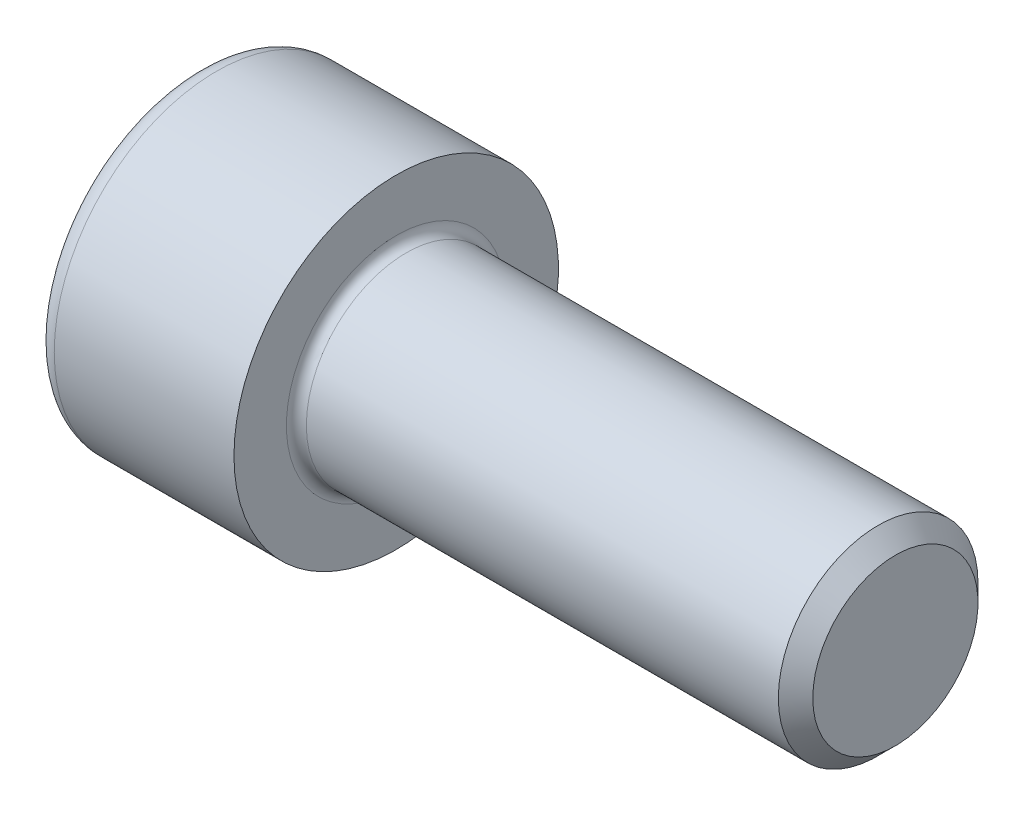
ISO-10303-21;
HEADER;
FILE_DESCRIPTION(('STEP AP214'),'2;1');
FILE_NAME('part.step','',(''),(''),'','','');
FILE_SCHEMA(('AUTOMOTIVE_DESIGN { 1 0 10303 214 1 1 1 1 }'));
ENDSEC;
DATA;
#1=APPLICATION_CONTEXT('core data for automotive mechanical design processes');
#2=APPLICATION_PROTOCOL_DEFINITION('international standard','automotive_design',2000,#1);
#3=PRODUCT_CONTEXT('',#1,'mechanical');
#4=PRODUCT('Part','Part','',(#3));
#5=PRODUCT_RELATED_PRODUCT_CATEGORY('part','',(#4));
#6=PRODUCT_DEFINITION_FORMATION('','',#4);
#7=PRODUCT_DEFINITION_CONTEXT('part definition',#1,'design');
#8=PRODUCT_DEFINITION('design','',#6,#7);
#9=PRODUCT_DEFINITION_SHAPE('','',#8);
#10=(LENGTH_UNIT() NAMED_UNIT(*) SI_UNIT(.MILLI.,.METRE.));
#11=(NAMED_UNIT(*) PLANE_ANGLE_UNIT() SI_UNIT($,.RADIAN.));
#12=(NAMED_UNIT(*) SI_UNIT($,.STERADIAN.) SOLID_ANGLE_UNIT());
#13=UNCERTAINTY_MEASURE_WITH_UNIT(LENGTH_MEASURE(1.E-05),#10,'distance_accuracy_value','');
#14=(GEOMETRIC_REPRESENTATION_CONTEXT(3) GLOBAL_UNCERTAINTY_ASSIGNED_CONTEXT((#13)) GLOBAL_UNIT_ASSIGNED_CONTEXT((#10,
#11,#12)) REPRESENTATION_CONTEXT('',''));
#15=CARTESIAN_POINT('',(0.,0.,0.));
#16=DIRECTION('',(0.,0.,1.));
#17=DIRECTION('',(1.,0.,0.));
#18=AXIS2_PLACEMENT_3D('',#15,#16,#17);
#19=CARTESIAN_POINT('',(0.,0.,0.));
#20=DIRECTION('',(-1.,0.,0.));
#21=DIRECTION('',(0.,0.,1.));
#22=AXIS2_PLACEMENT_3D('',#19,#20,#21);
#23=PLANE('',#22);
#24=DIRECTION('',(0.,-0.499999999999998,0.86602540378444));
#25=VECTOR('',#24,1.);
#26=CARTESIAN_POINT('',(0.,3.47564862052154,0.));
#27=LINE('',#26,#25);
#28=CARTESIAN_POINT('',(0.,3.47564862052154,0.));
#29=VERTEX_POINT('',#28);
#30=CARTESIAN_POINT('',(0.,1.73782431026077,3.01));
#31=VERTEX_POINT('',#30);
#32=EDGE_CURVE('E270',#29,#31,#27,.T.);
#33=ORIENTED_EDGE('',*,*,#32,.T.);
#34=DIRECTION('',(0.,1.,0.));
#35=VECTOR('',#34,1.);
#36=CARTESIAN_POINT('',(0.,-1.73782431026078,3.01000000000001));
#37=LINE('',#36,#35);
#38=CARTESIAN_POINT('',(0.,-1.73782431026078,3.01000000000001));
#39=VERTEX_POINT('',#38);
#40=EDGE_CURVE('E131',#39,#31,#37,.T.);
#41=ORIENTED_EDGE('',*,*,#40,.F.);
#42=DIRECTION('',(0.,-0.500000000000001,-0.866025403784438));
#43=VECTOR('',#42,1.);
#44=CARTESIAN_POINT('',(0.,-1.73782431026078,3.01000000000001));
#45=LINE('',#44,#43);
#46=CARTESIAN_POINT('',(0.,-3.47564862052155,0.));
#47=VERTEX_POINT('',#46);
#48=EDGE_CURVE('E273',#39,#47,#45,.T.);
#49=ORIENTED_EDGE('',*,*,#48,.T.);
#50=DIRECTION('',(0.,0.499999999999998,-0.86602540378444));
#51=VECTOR('',#50,1.);
#52=CARTESIAN_POINT('',(0.,-3.47564862052155,0.));
#53=LINE('',#52,#51);
#54=CARTESIAN_POINT('',(0.,-1.73782431026079,-3.00999999999999));
#55=VERTEX_POINT('',#54);
#56=EDGE_CURVE('E276',#47,#55,#53,.T.);
#57=ORIENTED_EDGE('',*,*,#56,.T.);
#58=DIRECTION('',(0.,-1.,0.));
#59=VECTOR('',#58,1.);
#60=CARTESIAN_POINT('',(0.,1.73782431026076,-3.01));
#61=LINE('',#60,#59);
#62=CARTESIAN_POINT('',(0.,1.73782431026076,-3.01));
#63=VERTEX_POINT('',#62);
#64=EDGE_CURVE('E279',#63,#55,#61,.T.);
#65=ORIENTED_EDGE('',*,*,#64,.F.);
#66=DIRECTION('',(0.,-0.500000000000001,-0.866025403784438));
#67=VECTOR('',#66,1.);
#68=CARTESIAN_POINT('',(0.,3.47564862052154,0.));
#69=LINE('',#68,#67);
#70=EDGE_CURVE('E126',#29,#63,#69,.T.);
#71=ORIENTED_EDGE('',*,*,#70,.F.);
#72=EDGE_LOOP('',(#33,#41,#49,#57,#65,#71));
#73=FACE_BOUND('',#72,.T.);
#74=CARTESIAN_POINT('',(0.,0.,0.));
#75=DIRECTION('',(-1.,0.,0.));
#76=DIRECTION('',(0.,0.,1.));
#77=AXIS2_PLACEMENT_3D('',#74,#75,#76);
#78=CIRCLE('',#77,5.7);
#79=CARTESIAN_POINT('',(0.,0.,5.7));
#80=VERTEX_POINT('',#79);
#81=EDGE_CURVE('E47',#80,#80,#78,.T.);
#82=ORIENTED_EDGE('',*,*,#81,.T.);
#83=EDGE_LOOP('',(#82));
#84=FACE_BOUND('',#83,.T.);
#85=ADVANCED_FACE('F39',(#73,#84),#23,.T.);
#86=CARTESIAN_POINT('',(-31.75,0.,0.));
#87=DIRECTION('',(-1.,0.,0.));
#88=DIRECTION('',(0.,0.,1.));
#89=AXIS2_PLACEMENT_3D('',#86,#87,#88);
#90=CYLINDRICAL_SURFACE('',#89,6.5);
#91=CARTESIAN_POINT('',(0.800000000000002,0.,0.));
#92=DIRECTION('',(-1.,0.,0.));
#93=DIRECTION('',(0.,0.,1.));
#94=AXIS2_PLACEMENT_3D('',#91,#92,#93);
#95=CIRCLE('',#94,6.5);
#96=CARTESIAN_POINT('',(0.800000000000002,0.,6.5));
#97=VERTEX_POINT('',#96);
#98=EDGE_CURVE('E11',#97,#97,#95,.F.);
#99=ORIENTED_EDGE('',*,*,#98,.T.);
#100=EDGE_LOOP('',(#99));
#101=FACE_BOUND('',#100,.T.);
#102=CARTESIAN_POINT('',(8.,0.,0.));
#103=DIRECTION('',(-1.,0.,0.));
#104=DIRECTION('',(0.,0.,1.));
#105=AXIS2_PLACEMENT_3D('',#102,#103,#104);
#106=CIRCLE('',#105,6.5);
#107=CARTESIAN_POINT('',(8.,0.,6.5));
#108=VERTEX_POINT('',#107);
#109=EDGE_CURVE('E149',#108,#108,#106,.T.);
#110=ORIENTED_EDGE('',*,*,#109,.T.);
#111=EDGE_LOOP('',(#110));
#112=FACE_BOUND('',#111,.T.);
#113=ADVANCED_FACE('F173',(#101,#112),#90,.T.);
#114=CARTESIAN_POINT('',(8.,6.5,0.));
#115=DIRECTION('',(1.,0.,0.));
#116=DIRECTION('',(0.,0.,-1.));
#117=AXIS2_PLACEMENT_3D('',#114,#115,#116);
#118=PLANE('',#117);
#119=CARTESIAN_POINT('',(8.,0.,0.));
#120=DIRECTION('',(1.,0.,0.));
#121=DIRECTION('',(0.,0.,-1.));
#122=AXIS2_PLACEMENT_3D('',#119,#120,#121);
#123=CIRCLE('',#122,4.39999999999999);
#124=CARTESIAN_POINT('',(8.,0.,-4.39999999999999));
#125=VERTEX_POINT('',#124);
#126=EDGE_CURVE('E152',#125,#125,#123,.F.);
#127=ORIENTED_EDGE('',*,*,#126,.T.);
#128=EDGE_LOOP('',(#127));
#129=FACE_BOUND('',#128,.T.);
#130=ORIENTED_EDGE('',*,*,#109,.F.);
#131=EDGE_LOOP('',(#130));
#132=FACE_BOUND('',#131,.T.);
#133=ADVANCED_FACE('F179',(#129,#132),#118,.T.);
#134=CARTESIAN_POINT('',(-31.75,0.,0.));
#135=DIRECTION('',(-1.,0.,0.));
#136=DIRECTION('',(0.,0.,1.));
#137=AXIS2_PLACEMENT_3D('',#134,#135,#136);
#138=CYLINDRICAL_SURFACE('',#137,3.99999999999999);
#139=CARTESIAN_POINT('',(8.4,0.,0.));
#140=DIRECTION('',(1.,0.,0.));
#141=DIRECTION('',(0.,0.,-1.));
#142=AXIS2_PLACEMENT_3D('',#139,#140,#141);
#143=CIRCLE('',#142,3.99999999999999);
#144=CARTESIAN_POINT('',(8.4,0.,-3.99999999999999));
#145=VERTEX_POINT('',#144);
#146=EDGE_CURVE('E155',#145,#145,#143,.T.);
#147=ORIENTED_EDGE('',*,*,#146,.T.);
#148=EDGE_LOOP('',(#147));
#149=FACE_BOUND('',#148,.T.);
#150=CARTESIAN_POINT('',(27.3095,0.,0.));
#151=DIRECTION('',(-1.,0.,0.));
#152=DIRECTION('',(0.,0.,1.));
#153=AXIS2_PLACEMENT_3D('',#150,#151,#152);
#154=CIRCLE('',#153,3.99999999999998);
#155=CARTESIAN_POINT('',(27.3095,0.,3.99999999999998));
#156=VERTEX_POINT('',#155);
#157=EDGE_CURVE('E146',#156,#156,#154,.T.);
#158=ORIENTED_EDGE('',*,*,#157,.T.);
#159=EDGE_LOOP('',(#158));
#160=FACE_BOUND('',#159,.T.);
#161=ADVANCED_FACE('F185',(#149,#160),#138,.T.);
#162=CARTESIAN_POINT('',(28.,0.,0.));
#163=DIRECTION('',(-1.,0.,0.));
#164=DIRECTION('',(0.,0.,1.));
#165=AXIS2_PLACEMENT_3D('',#162,#163,#164);
#166=CONICAL_SURFACE('',#165,3.3095,0.785398163397426);
#167=ORIENTED_EDGE('',*,*,#157,.F.);
#168=EDGE_LOOP('',(#167));
#169=FACE_BOUND('',#168,.T.);
#170=CARTESIAN_POINT('',(28.,0.,0.));
#171=DIRECTION('',(-1.,0.,0.));
#172=DIRECTION('',(0.,0.,1.));
#173=AXIS2_PLACEMENT_3D('',#170,#171,#172);
#174=CIRCLE('',#173,3.3095);
#175=CARTESIAN_POINT('',(28.,0.,3.3095));
#176=VERTEX_POINT('',#175);
#177=EDGE_CURVE('E142',#176,#176,#174,.T.);
#178=ORIENTED_EDGE('',*,*,#177,.T.);
#179=EDGE_LOOP('',(#178));
#180=FACE_BOUND('',#179,.T.);
#181=ADVANCED_FACE('F189',(#169,#180),#166,.T.);
#182=CARTESIAN_POINT('',(28.,3.3095,0.));
#183=DIRECTION('',(1.,0.,0.));
#184=DIRECTION('',(0.,0.,-1.));
#185=AXIS2_PLACEMENT_3D('',#182,#183,#184);
#186=PLANE('',#185);
#187=ORIENTED_EDGE('',*,*,#177,.F.);
#188=EDGE_LOOP('',(#187));
#189=FACE_BOUND('',#188,.T.);
#190=ADVANCED_FACE('F169',(#189),#186,.T.);
#191=CARTESIAN_POINT('',(8.4,0.,0.));
#192=DIRECTION('',(1.,0.,0.));
#193=DIRECTION('',(0.,0.,-1.));
#194=AXIS2_PLACEMENT_3D('',#191,#192,#193);
#195=TOROIDAL_SURFACE('',#194,4.39999999999999,0.4);
#196=ORIENTED_EDGE('',*,*,#146,.F.);
#197=EDGE_LOOP('',(#196));
#198=FACE_BOUND('',#197,.T.);
#199=ORIENTED_EDGE('',*,*,#126,.F.);
#200=EDGE_LOOP('',(#199));
#201=FACE_BOUND('',#200,.T.);
#202=ADVANCED_FACE('F162',(#198,#201),#195,.F.);
#203=CARTESIAN_POINT('',(0.800000000000002,0.,0.));
#204=DIRECTION('',(-1.,0.,0.));
#205=DIRECTION('',(0.,0.,1.));
#206=AXIS2_PLACEMENT_3D('',#203,#204,#205);
#207=TOROIDAL_SURFACE('',#206,5.7,0.8);
#208=ORIENTED_EDGE('',*,*,#98,.F.);
#209=EDGE_LOOP('',(#208));
#210=FACE_BOUND('',#209,.T.);
#211=ORIENTED_EDGE('',*,*,#81,.F.);
#212=EDGE_LOOP('',(#211));
#213=FACE_BOUND('',#212,.T.);
#214=ADVANCED_FACE('F41',(#210,#213),#207,.T.);
#215=CARTESIAN_POINT('',(4.,3.47564862052154,0.));
#216=DIRECTION('',(0.,-0.86602540378444,-0.499999999999998));
#217=DIRECTION('',(0.,0.499999999999998,-0.86602540378444));
#218=AXIS2_PLACEMENT_3D('',#215,#216,#217);
#219=PLANE('',#218);
#220=ORIENTED_EDGE('',*,*,#32,.F.);
#221=DIRECTION('',(-1.,0.,0.));
#222=VECTOR('',#221,1.);
#223=CARTESIAN_POINT('',(4.,3.47564862052154,0.));
#224=LINE('',#223,#222);
#225=CARTESIAN_POINT('',(4.,3.47564862052154,0.));
#226=VERTEX_POINT('',#225);
#227=EDGE_CURVE('E269',#226,#29,#224,.T.);
#228=ORIENTED_EDGE('',*,*,#227,.F.);
#229=DIRECTION('',(0.,-0.499999999999998,0.86602540378444));
#230=VECTOR('',#229,1.);
#231=CARTESIAN_POINT('',(4.,3.47564862052154,0.));
#232=LINE('',#231,#230);
#233=CARTESIAN_POINT('',(4.,2.60673646539116,1.50499999999999));
#234=VERTEX_POINT('',#233);
#235=EDGE_CURVE('E54',#226,#234,#232,.T.);
#236=ORIENTED_EDGE('',*,*,#235,.T.);
#237=CARTESIAN_POINT('',(4.,1.73782431026077,3.01));
#238=VERTEX_POINT('',#237);
#239=EDGE_CURVE('E112',#234,#238,#232,.T.);
#240=ORIENTED_EDGE('',*,*,#239,.T.);
#241=DIRECTION('',(-1.,0.,0.));
#242=VECTOR('',#241,1.);
#243=CARTESIAN_POINT('',(4.,1.73782431026077,3.01));
#244=LINE('',#243,#242);
#245=EDGE_CURVE('E124',#238,#31,#244,.T.);
#246=ORIENTED_EDGE('',*,*,#245,.T.);
#247=EDGE_LOOP('',(#220,#228,#236,#240,#246));
#248=FACE_BOUND('',#247,.T.);
#249=ADVANCED_FACE('F123',(#248),#219,.T.);
#250=CARTESIAN_POINT('',(4.,-1.73782431026078,3.01000000000001));
#251=DIRECTION('',(0.,0.,1.));
#252=DIRECTION('',(0.,-1.,0.));
#253=AXIS2_PLACEMENT_3D('',#250,#251,#252);
#254=PLANE('',#253);
#255=ORIENTED_EDGE('',*,*,#40,.T.);
#256=ORIENTED_EDGE('',*,*,#245,.F.);
#257=DIRECTION('',(0.,1.,0.));
#258=VECTOR('',#257,1.);
#259=CARTESIAN_POINT('',(4.,-1.73782431026078,3.01000000000001));
#260=LINE('',#259,#258);
#261=CARTESIAN_POINT('',(4.,0.,3.01));
#262=VERTEX_POINT('',#261);
#263=EDGE_CURVE('E110',#262,#238,#260,.T.);
#264=ORIENTED_EDGE('',*,*,#263,.F.);
#265=CARTESIAN_POINT('',(4.,-1.73782431026078,3.01000000000001));
#266=VERTEX_POINT('',#265);
#267=EDGE_CURVE('E120',#266,#262,#260,.T.);
#268=ORIENTED_EDGE('',*,*,#267,.F.);
#269=DIRECTION('',(-1.,0.,0.));
#270=VECTOR('',#269,1.);
#271=CARTESIAN_POINT('',(4.,-1.73782431026078,3.01000000000001));
#272=LINE('',#271,#270);
#273=EDGE_CURVE('E133',#266,#39,#272,.T.);
#274=ORIENTED_EDGE('',*,*,#273,.T.);
#275=EDGE_LOOP('',(#255,#256,#264,#268,#274));
#276=FACE_BOUND('',#275,.T.);
#277=ADVANCED_FACE('F128',(#276),#254,.F.);
#278=CARTESIAN_POINT('',(4.,-1.73782431026078,3.01000000000001));
#279=DIRECTION('',(0.,0.866025403784438,-0.500000000000001));
#280=DIRECTION('',(0.,0.500000000000001,0.866025403784438));
#281=AXIS2_PLACEMENT_3D('',#278,#279,#280);
#282=PLANE('',#281);
#283=ORIENTED_EDGE('',*,*,#48,.F.);
#284=ORIENTED_EDGE('',*,*,#273,.F.);
#285=DIRECTION('',(0.,-0.500000000000001,-0.866025403784438));
#286=VECTOR('',#285,1.);
#287=CARTESIAN_POINT('',(4.,-1.73782431026078,3.01000000000001));
#288=LINE('',#287,#286);
#289=CARTESIAN_POINT('',(4.,-2.60673646539116,1.50500000000001));
#290=VERTEX_POINT('',#289);
#291=EDGE_CURVE('E250',#266,#290,#288,.T.);
#292=ORIENTED_EDGE('',*,*,#291,.T.);
#293=CARTESIAN_POINT('',(4.,-3.47564862052155,0.));
#294=VERTEX_POINT('',#293);
#295=EDGE_CURVE('E252',#290,#294,#288,.T.);
#296=ORIENTED_EDGE('',*,*,#295,.T.);
#297=DIRECTION('',(-1.,0.,0.));
#298=VECTOR('',#297,1.);
#299=CARTESIAN_POINT('',(4.,-3.47564862052155,0.));
#300=LINE('',#299,#298);
#301=EDGE_CURVE('E138',#294,#47,#300,.T.);
#302=ORIENTED_EDGE('',*,*,#301,.T.);
#303=EDGE_LOOP('',(#283,#284,#292,#296,#302));
#304=FACE_BOUND('',#303,.T.);
#305=ADVANCED_FACE('F202',(#304),#282,.T.);
#306=CARTESIAN_POINT('',(4.,-3.47564862052155,0.));
#307=DIRECTION('',(0.,0.86602540378444,0.499999999999998));
#308=DIRECTION('',(0.,-0.499999999999998,0.86602540378444));
#309=AXIS2_PLACEMENT_3D('',#306,#307,#308);
#310=PLANE('',#309);
#311=ORIENTED_EDGE('',*,*,#56,.F.);
#312=ORIENTED_EDGE('',*,*,#301,.F.);
#313=DIRECTION('',(0.,0.499999999999998,-0.86602540378444));
#314=VECTOR('',#313,1.);
#315=CARTESIAN_POINT('',(4.,-3.47564862052155,0.));
#316=LINE('',#315,#314);
#317=CARTESIAN_POINT('',(4.,-2.60673646539117,-1.505));
#318=VERTEX_POINT('',#317);
#319=EDGE_CURVE('E255',#294,#318,#316,.T.);
#320=ORIENTED_EDGE('',*,*,#319,.T.);
#321=CARTESIAN_POINT('',(4.,-1.73782431026079,-3.00999999999999));
#322=VERTEX_POINT('',#321);
#323=EDGE_CURVE('E259',#318,#322,#316,.T.);
#324=ORIENTED_EDGE('',*,*,#323,.T.);
#325=DIRECTION('',(-1.,0.,0.));
#326=VECTOR('',#325,1.);
#327=CARTESIAN_POINT('',(4.,-1.73782431026079,-3.00999999999999));
#328=LINE('',#327,#326);
#329=EDGE_CURVE('E288',#322,#55,#328,.T.);
#330=ORIENTED_EDGE('',*,*,#329,.T.);
#331=EDGE_LOOP('',(#311,#312,#320,#324,#330));
#332=FACE_BOUND('',#331,.T.);
#333=ADVANCED_FACE('F205',(#332),#310,.T.);
#334=CARTESIAN_POINT('',(4.,1.73782431026076,-3.01));
#335=DIRECTION('',(0.,0.,-1.));
#336=DIRECTION('',(0.,1.,0.));
#337=AXIS2_PLACEMENT_3D('',#334,#335,#336);
#338=PLANE('',#337);
#339=ORIENTED_EDGE('',*,*,#64,.T.);
#340=ORIENTED_EDGE('',*,*,#329,.F.);
#341=DIRECTION('',(0.,-1.,0.));
#342=VECTOR('',#341,1.);
#343=CARTESIAN_POINT('',(4.,1.73782431026076,-3.01));
#344=LINE('',#343,#342);
#345=CARTESIAN_POINT('',(4.,0.,-3.01));
#346=VERTEX_POINT('',#345);
#347=EDGE_CURVE('E263',#346,#322,#344,.T.);
#348=ORIENTED_EDGE('',*,*,#347,.F.);
#349=CARTESIAN_POINT('',(4.,1.73782431026076,-3.01));
#350=VERTEX_POINT('',#349);
#351=EDGE_CURVE('E264',#350,#346,#344,.T.);
#352=ORIENTED_EDGE('',*,*,#351,.F.);
#353=DIRECTION('',(-1.,0.,0.));
#354=VECTOR('',#353,1.);
#355=CARTESIAN_POINT('',(4.,1.73782431026076,-3.01));
#356=LINE('',#355,#354);
#357=EDGE_CURVE('E285',#350,#63,#356,.T.);
#358=ORIENTED_EDGE('',*,*,#357,.T.);
#359=EDGE_LOOP('',(#339,#340,#348,#352,#358));
#360=FACE_BOUND('',#359,.T.);
#361=ADVANCED_FACE('F209',(#360),#338,.F.);
#362=CARTESIAN_POINT('',(4.,3.47564862052154,0.));
#363=DIRECTION('',(0.,0.866025403784438,-0.500000000000001));
#364=DIRECTION('',(0.,0.500000000000001,0.866025403784438));
#365=AXIS2_PLACEMENT_3D('',#362,#363,#364);
#366=PLANE('',#365);
#367=ORIENTED_EDGE('',*,*,#70,.T.);
#368=ORIENTED_EDGE('',*,*,#357,.F.);
#369=DIRECTION('',(0.,-0.500000000000001,-0.866025403784438));
#370=VECTOR('',#369,1.);
#371=CARTESIAN_POINT('',(4.,3.47564862052154,0.));
#372=LINE('',#371,#370);
#373=CARTESIAN_POINT('',(4.,2.60673646539115,-1.505));
#374=VERTEX_POINT('',#373);
#375=EDGE_CURVE('E267',#374,#350,#372,.T.);
#376=ORIENTED_EDGE('',*,*,#375,.F.);
#377=EDGE_CURVE('E241',#226,#374,#372,.T.);
#378=ORIENTED_EDGE('',*,*,#377,.F.);
#379=ORIENTED_EDGE('',*,*,#227,.T.);
#380=EDGE_LOOP('',(#367,#368,#376,#378,#379));
#381=FACE_BOUND('',#380,.T.);
#382=ADVANCED_FACE('F213',(#381),#366,.F.);
#383=CARTESIAN_POINT('',(4.,1.73782431026077,3.01));
#384=DIRECTION('',(-1.,0.,0.));
#385=DIRECTION('',(0.,0.,1.));
#386=AXIS2_PLACEMENT_3D('',#383,#384,#385);
#387=PLANE('',#386);
#388=CARTESIAN_POINT('',(4.,0.,0.));
#389=DIRECTION('',(-1.,0.,0.));
#390=DIRECTION('',(0.,0.,1.));
#391=AXIS2_PLACEMENT_3D('',#388,#389,#390);
#392=CIRCLE('',#391,3.01);
#393=EDGE_CURVE('E132',#290,#262,#392,.T.);
#394=ORIENTED_EDGE('',*,*,#393,.F.);
#395=ORIENTED_EDGE('',*,*,#291,.F.);
#396=ORIENTED_EDGE('',*,*,#267,.T.);
#397=EDGE_LOOP('',(#394,#395,#396));
#398=FACE_BOUND('',#397,.T.);
#399=ADVANCED_FACE('F217',(#398),#387,.T.);
#400=EDGE_CURVE('E136',#318,#290,#392,.T.);
#401=ORIENTED_EDGE('',*,*,#400,.F.);
#402=ORIENTED_EDGE('',*,*,#319,.F.);
#403=ORIENTED_EDGE('',*,*,#295,.F.);
#404=EDGE_LOOP('',(#401,#402,#403));
#405=FACE_BOUND('',#404,.T.);
#406=ADVANCED_FACE('F220',(#405),#387,.T.);
#407=EDGE_CURVE('E294',#346,#318,#392,.T.);
#408=ORIENTED_EDGE('',*,*,#407,.F.);
#409=ORIENTED_EDGE('',*,*,#347,.T.);
#410=ORIENTED_EDGE('',*,*,#323,.F.);
#411=EDGE_LOOP('',(#408,#409,#410));
#412=FACE_BOUND('',#411,.T.);
#413=ADVANCED_FACE('F225',(#412),#387,.T.);
#414=EDGE_CURVE('E244',#374,#346,#392,.T.);
#415=ORIENTED_EDGE('',*,*,#414,.F.);
#416=ORIENTED_EDGE('',*,*,#375,.T.);
#417=ORIENTED_EDGE('',*,*,#351,.T.);
#418=EDGE_LOOP('',(#415,#416,#417));
#419=FACE_BOUND('',#418,.T.);
#420=ADVANCED_FACE('F232',(#419),#387,.T.);
#421=EDGE_CURVE('E143',#234,#374,#392,.T.);
#422=ORIENTED_EDGE('',*,*,#421,.F.);
#423=ORIENTED_EDGE('',*,*,#235,.F.);
#424=ORIENTED_EDGE('',*,*,#377,.T.);
#425=EDGE_LOOP('',(#422,#423,#424));
#426=FACE_BOUND('',#425,.T.);
#427=ADVANCED_FACE('F228',(#426),#387,.T.);
#428=EDGE_CURVE('E115',#262,#234,#392,.T.);
#429=ORIENTED_EDGE('',*,*,#428,.F.);
#430=ORIENTED_EDGE('',*,*,#263,.T.);
#431=ORIENTED_EDGE('',*,*,#239,.F.);
#432=EDGE_LOOP('',(#429,#430,#431));
#433=FACE_BOUND('',#432,.T.);
#434=ADVANCED_FACE('F111',(#433),#387,.T.);
#435=CARTESIAN_POINT('',(4.,0.,0.));
#436=DIRECTION('',(-1.,0.,0.));
#437=DIRECTION('',(0.,0.,1.));
#438=AXIS2_PLACEMENT_3D('',#435,#436,#437);
#439=CONICAL_SURFACE('',#438,3.01,1.04719755119659);
#440=CARTESIAN_POINT('',(5.73782431026079,0.,0.));
#441=VERTEX_POINT('',#440);
#442=VERTEX_LOOP('',#441);
#443=FACE_BOUND('',#442,.T.);
#444=ORIENTED_EDGE('',*,*,#428,.T.);
#445=ORIENTED_EDGE('',*,*,#421,.T.);
#446=ORIENTED_EDGE('',*,*,#414,.T.);
#447=ORIENTED_EDGE('',*,*,#407,.T.);
#448=ORIENTED_EDGE('',*,*,#400,.T.);
#449=ORIENTED_EDGE('',*,*,#393,.T.);
#450=EDGE_LOOP('',(#444,#445,#446,#447,#448,#449));
#451=FACE_BOUND('',#450,.T.);
#452=ADVANCED_FACE('F197',(#443,#451),#439,.F.);
#453=CLOSED_SHELL('',(#85,#113,#133,#161,#181,#190,#202,#214,#249,#277,#305,#333,#361,#382,#399,
#406,#413,#420,#427,#434,#452));
#454=MANIFOLD_SOLID_BREP('B2',#453);
#455=ADVANCED_BREP_SHAPE_REPRESENTATION('',(#18,#454),#14);
#456=SHAPE_DEFINITION_REPRESENTATION(#9,#455);
ENDSEC;
END-ISO-10303-21;
